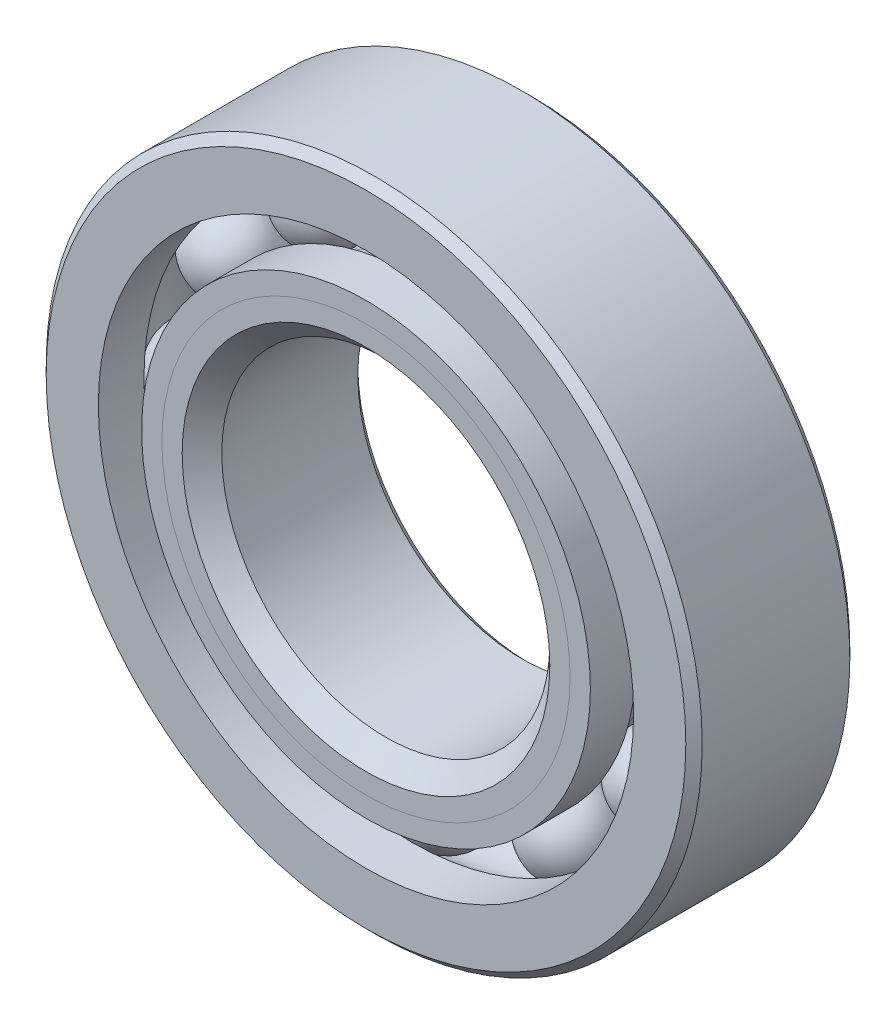
ISO-10303-21;
HEADER;
FILE_DESCRIPTION(('STEP AP214'),'2;1');
FILE_NAME('part.step','',(''),(''),'','','');
FILE_SCHEMA(('AUTOMOTIVE_DESIGN { 1 0 10303 214 1 1 1 1 }'));
ENDSEC;
DATA;
#1=APPLICATION_CONTEXT('core data for automotive mechanical design processes');
#2=APPLICATION_PROTOCOL_DEFINITION('international standard','automotive_design',2000,#1);
#3=PRODUCT_CONTEXT('',#1,'mechanical');
#4=PRODUCT('Part','Part','',(#3));
#5=PRODUCT_RELATED_PRODUCT_CATEGORY('part','',(#4));
#6=PRODUCT_DEFINITION_FORMATION('','',#4);
#7=PRODUCT_DEFINITION_CONTEXT('part definition',#1,'design');
#8=PRODUCT_DEFINITION('design','',#6,#7);
#9=PRODUCT_DEFINITION_SHAPE('','',#8);
#10=(LENGTH_UNIT() NAMED_UNIT(*) SI_UNIT(.MILLI.,.METRE.));
#11=(NAMED_UNIT(*) PLANE_ANGLE_UNIT() SI_UNIT($,.RADIAN.));
#12=(NAMED_UNIT(*) SI_UNIT($,.STERADIAN.) SOLID_ANGLE_UNIT());
#13=UNCERTAINTY_MEASURE_WITH_UNIT(LENGTH_MEASURE(1.E-05),#10,'distance_accuracy_value','');
#14=(GEOMETRIC_REPRESENTATION_CONTEXT(3) GLOBAL_UNCERTAINTY_ASSIGNED_CONTEXT((#13)) GLOBAL_UNIT_ASSIGNED_CONTEXT((#10,
#11,#12)) REPRESENTATION_CONTEXT('',''));
#15=CARTESIAN_POINT('',(0.,0.,0.));
#16=DIRECTION('',(0.,0.,1.));
#17=DIRECTION('',(1.,0.,0.));
#18=AXIS2_PLACEMENT_3D('',#15,#16,#17);
#19=CARTESIAN_POINT('',(-2.38124999999995,4.12444598552342,0.));
#20=DIRECTION('',(0.,0.,1.));
#21=DIRECTION('',(-0.499999999999989,0.866025403784445,0.));
#22=AXIS2_PLACEMENT_3D('',#19,#20,#21);
#23=SPHERICAL_SURFACE('',#22,0.820428356767388);
#24=CARTESIAN_POINT('',(-2.38124999999995,4.12444598552342,0.820428356767388));
#25=VERTEX_POINT('',#24);
#26=VERTEX_LOOP('',#25);
#27=FACE_BOUND('',#26,.T.);
#28=ADVANCED_FACE('F46',(#27),#23,.T.);
#29=CLOSED_SHELL('',(#28));
#30=MANIFOLD_SOLID_BREP('B2',#29);
#31=CARTESIAN_POINT('',(-4.12444598552336,2.38125000000005,0.));
#32=DIRECTION('',(0.,0.,1.));
#33=DIRECTION('',(-0.866025403784433,0.50000000000001,0.));
#34=AXIS2_PLACEMENT_3D('',#31,#32,#33);
#35=SPHERICAL_SURFACE('',#34,0.820428356767388);
#36=CARTESIAN_POINT('',(-4.12444598552336,2.38125000000005,0.820428356767388));
#37=VERTEX_POINT('',#36);
#38=VERTEX_LOOP('',#37);
#39=FACE_BOUND('',#38,.T.);
#40=ADVANCED_FACE('F85',(#39),#35,.T.);
#41=CLOSED_SHELL('',(#40));
#42=MANIFOLD_SOLID_BREP('B6',#41);
#43=CARTESIAN_POINT('',(-4.7625,0.,0.));
#44=DIRECTION('',(0.,0.,1.));
#45=DIRECTION('',(-1.,0.,0.));
#46=AXIS2_PLACEMENT_3D('',#43,#44,#45);
#47=SPHERICAL_SURFACE('',#46,0.820428356767388);
#48=CARTESIAN_POINT('',(-4.7625,0.,0.820428356767388));
#49=VERTEX_POINT('',#48);
#50=VERTEX_LOOP('',#49);
#51=FACE_BOUND('',#50,.T.);
#52=ADVANCED_FACE('F124',(#51),#47,.T.);
#53=CLOSED_SHELL('',(#52));
#54=MANIFOLD_SOLID_BREP('B42',#53);
#55=CARTESIAN_POINT('',(-4.12444598552341,-2.38124999999996,0.));
#56=DIRECTION('',(0.,0.,1.));
#57=DIRECTION('',(-0.866025403784443,-0.499999999999992,0.));
#58=AXIS2_PLACEMENT_3D('',#55,#56,#57);
#59=SPHERICAL_SURFACE('',#58,0.820428356767388);
#60=CARTESIAN_POINT('',(-4.12444598552341,-2.38124999999996,0.820428356767388));
#61=VERTEX_POINT('',#60);
#62=VERTEX_LOOP('',#61);
#63=FACE_BOUND('',#62,.T.);
#64=ADVANCED_FACE('F163',(#63),#59,.T.);
#65=CLOSED_SHELL('',(#64));
#66=MANIFOLD_SOLID_BREP('B81',#65);
#67=CARTESIAN_POINT('',(-2.38125000000003,-4.12444598552337,0.));
#68=DIRECTION('',(0.,0.,1.));
#69=DIRECTION('',(-0.500000000000007,-0.866025403784435,0.));
#70=AXIS2_PLACEMENT_3D('',#67,#68,#69);
#71=SPHERICAL_SURFACE('',#70,0.820428356767388);
#72=CARTESIAN_POINT('',(-2.38125000000003,-4.12444598552337,0.820428356767388));
#73=VERTEX_POINT('',#72);
#74=VERTEX_LOOP('',#73);
#75=FACE_BOUND('',#74,.T.);
#76=ADVANCED_FACE('F202',(#75),#71,.T.);
#77=CLOSED_SHELL('',(#76));
#78=MANIFOLD_SOLID_BREP('B120',#77);
#79=CARTESIAN_POINT('',(0.,-4.7625,0.));
#80=DIRECTION('',(0.,0.,1.));
#81=DIRECTION('',(0.,-1.,0.));
#82=AXIS2_PLACEMENT_3D('',#79,#80,#81);
#83=SPHERICAL_SURFACE('',#82,0.820428356767388);
#84=CARTESIAN_POINT('',(0.,-4.7625,0.820428356767388));
#85=VERTEX_POINT('',#84);
#86=VERTEX_LOOP('',#85);
#87=FACE_BOUND('',#86,.T.);
#88=ADVANCED_FACE('F241',(#87),#83,.T.);
#89=CLOSED_SHELL('',(#88));
#90=MANIFOLD_SOLID_BREP('B159',#89);
#91=CARTESIAN_POINT('',(2.38124999999998,-4.1244459855234,0.));
#92=DIRECTION('',(0.,0.,1.));
#93=DIRECTION('',(0.499999999999995,-0.866025403784442,0.));
#94=AXIS2_PLACEMENT_3D('',#91,#92,#93);
#95=SPHERICAL_SURFACE('',#94,0.820428356767388);
#96=CARTESIAN_POINT('',(2.38124999999998,-4.1244459855234,0.820428356767388));
#97=VERTEX_POINT('',#96);
#98=VERTEX_LOOP('',#97);
#99=FACE_BOUND('',#98,.T.);
#100=ADVANCED_FACE('F280',(#99),#95,.T.);
#101=CLOSED_SHELL('',(#100));
#102=MANIFOLD_SOLID_BREP('B198',#101);
#103=CARTESIAN_POINT('',(4.12444598552338,-2.38125000000002,0.));
#104=DIRECTION('',(0.,0.,1.));
#105=DIRECTION('',(0.866025403784436,-0.500000000000004,0.));
#106=AXIS2_PLACEMENT_3D('',#103,#104,#105);
#107=SPHERICAL_SURFACE('',#106,0.820428356767388);
#108=CARTESIAN_POINT('',(4.12444598552338,-2.38125000000002,0.820428356767388));
#109=VERTEX_POINT('',#108);
#110=VERTEX_LOOP('',#109);
#111=FACE_BOUND('',#110,.T.);
#112=ADVANCED_FACE('F319',(#111),#107,.T.);
#113=CLOSED_SHELL('',(#112));
#114=MANIFOLD_SOLID_BREP('B237',#113);
#115=CARTESIAN_POINT('',(4.7625,0.,0.));
#116=DIRECTION('',(0.,0.,1.));
#117=DIRECTION('',(1.,0.,0.));
#118=AXIS2_PLACEMENT_3D('',#115,#116,#117);
#119=SPHERICAL_SURFACE('',#118,0.820428356767388);
#120=CARTESIAN_POINT('',(4.7625,0.,0.820428356767388));
#121=VERTEX_POINT('',#120);
#122=VERTEX_LOOP('',#121);
#123=FACE_BOUND('',#122,.T.);
#124=ADVANCED_FACE('F358',(#123),#119,.T.);
#125=CLOSED_SHELL('',(#124));
#126=MANIFOLD_SOLID_BREP('B276',#125);
#127=CARTESIAN_POINT('',(4.12444598552339,2.38124999999999,0.));
#128=DIRECTION('',(0.,0.,1.));
#129=DIRECTION('',(0.86602540378444,0.499999999999998,0.));
#130=AXIS2_PLACEMENT_3D('',#127,#128,#129);
#131=SPHERICAL_SURFACE('',#130,0.820428356767388);
#132=CARTESIAN_POINT('',(4.12444598552339,2.38124999999999,0.820428356767388));
#133=VERTEX_POINT('',#132);
#134=VERTEX_LOOP('',#133);
#135=FACE_BOUND('',#134,.T.);
#136=ADVANCED_FACE('F397',(#135),#131,.T.);
#137=CLOSED_SHELL('',(#136));
#138=MANIFOLD_SOLID_BREP('B315',#137);
#139=CARTESIAN_POINT('',(2.38125,4.12444598552339,0.));
#140=DIRECTION('',(0.,0.,1.));
#141=DIRECTION('',(0.500000000000001,0.866025403784438,0.));
#142=AXIS2_PLACEMENT_3D('',#139,#140,#141);
#143=SPHERICAL_SURFACE('',#142,0.820428356767388);
#144=CARTESIAN_POINT('',(2.38125,4.12444598552339,0.820428356767388));
#145=VERTEX_POINT('',#144);
#146=VERTEX_LOOP('',#145);
#147=FACE_BOUND('',#146,.T.);
#148=ADVANCED_FACE('F436',(#147),#143,.T.);
#149=CLOSED_SHELL('',(#148));
#150=MANIFOLD_SOLID_BREP('B354',#149);
#151=CARTESIAN_POINT('',(0.,4.7625,0.));
#152=DIRECTION('',(0.,0.,1.));
#153=DIRECTION('',(0.,1.,0.));
#154=AXIS2_PLACEMENT_3D('',#151,#152,#153);
#155=SPHERICAL_SURFACE('',#154,0.820428356767388);
#156=CARTESIAN_POINT('',(0.,4.7625,0.820428356767388));
#157=VERTEX_POINT('',#156);
#158=VERTEX_LOOP('',#157);
#159=FACE_BOUND('',#158,.T.);
#160=ADVANCED_FACE('F477',(#159),#155,.T.);
#161=CLOSED_SHELL('',(#160));
#162=MANIFOLD_SOLID_BREP('B393',#161);
#163=CARTESIAN_POINT('',(0.,3.95117725146749,1.5875));
#164=DIRECTION('',(0.,0.,-1.));
#165=DIRECTION('',(-1.,0.,0.));
#166=AXIS2_PLACEMENT_3D('',#163,#164,#165);
#167=PLANE('',#166);
#168=CARTESIAN_POINT('',(0.,0.,1.5875));
#169=DIRECTION('',(0.,0.,1.));
#170=DIRECTION('',(1.,0.,0.));
#171=AXIS2_PLACEMENT_3D('',#168,#169,#170);
#172=CIRCLE('',#171,3.55853582161631);
#173=CARTESIAN_POINT('',(3.55853582161631,0.,1.5875));
#174=VERTEX_POINT('',#173);
#175=EDGE_CURVE('E530',#174,#174,#172,.T.);
#176=ORIENTED_EDGE('',*,*,#175,.F.);
#177=EDGE_LOOP('',(#176));
#178=FACE_BOUND('',#177,.T.);
#179=CARTESIAN_POINT('',(0.,0.,1.5875));
#180=DIRECTION('',(0.,0.,1.));
#181=DIRECTION('',(1.,0.,0.));
#182=AXIS2_PLACEMENT_3D('',#179,#180,#181);
#183=CIRCLE('',#182,3.95117725146749);
#184=CARTESIAN_POINT('',(3.95117725146749,0.,1.5875));
#185=VERTEX_POINT('',#184);
#186=EDGE_CURVE('E476',#185,#185,#183,.T.);
#187=ORIENTED_EDGE('',*,*,#186,.T.);
#188=EDGE_LOOP('',(#187));
#189=FACE_BOUND('',#188,.T.);
#190=ADVANCED_FACE('F496',(#178,#189),#167,.F.);
#191=CARTESIAN_POINT('',(0.,0.,1.19485857014881));
#192=DIRECTION('',(0.,0.,1.));
#193=DIRECTION('',(1.,0.,0.));
#194=AXIS2_PLACEMENT_3D('',#191,#192,#193);
#195=CONICAL_SURFACE('',#194,3.55853582161631,0.785398163397449);
#196=ORIENTED_EDGE('',*,*,#186,.F.);
#197=EDGE_LOOP('',(#196));
#198=FACE_BOUND('',#197,.T.);
#199=CARTESIAN_POINT('',(0.,0.,1.19485857014881));
#200=DIRECTION('',(0.,0.,1.));
#201=DIRECTION('',(1.,0.,0.));
#202=AXIS2_PLACEMENT_3D('',#199,#200,#201);
#203=CIRCLE('',#202,3.55853582161631);
#204=CARTESIAN_POINT('',(3.55853582161631,0.,1.19485857014881));
#205=VERTEX_POINT('',#204);
#206=EDGE_CURVE('E502',#205,#205,#203,.T.);
#207=ORIENTED_EDGE('',*,*,#206,.T.);
#208=EDGE_LOOP('',(#207));
#209=FACE_BOUND('',#208,.T.);
#210=ADVANCED_FACE('F537',(#198,#209),#195,.T.);
#211=CARTESIAN_POINT('',(0.,0.,1.5875));
#212=DIRECTION('',(0.,0.,1.));
#213=DIRECTION('',(1.,0.,0.));
#214=AXIS2_PLACEMENT_3D('',#211,#212,#213);
#215=CYLINDRICAL_SURFACE('',#214,3.55853582161631);
#216=ORIENTED_EDGE('',*,*,#206,.F.);
#217=EDGE_LOOP('',(#216));
#218=FACE_BOUND('',#217,.T.);
#219=CARTESIAN_POINT('',(0.,0.,0.));
#220=DIRECTION('',(0.,0.,1.));
#221=DIRECTION('',(1.,0.,0.));
#222=AXIS2_PLACEMENT_3D('',#219,#220,#221);
#223=CIRCLE('',#222,3.55853582161631);
#224=CARTESIAN_POINT('',(3.55853582161631,0.,0.));
#225=VERTEX_POINT('',#224);
#226=EDGE_CURVE('E506',#225,#225,#223,.T.);
#227=ORIENTED_EDGE('',*,*,#226,.T.);
#228=EDGE_LOOP('',(#227));
#229=FACE_BOUND('',#228,.T.);
#230=ADVANCED_FACE('F541',(#218,#229),#215,.T.);
#231=CARTESIAN_POINT('',(0.,3.55853582161631,0.));
#232=DIRECTION('',(0.,0.,-1.));
#233=DIRECTION('',(-1.,0.,0.));
#234=AXIS2_PLACEMENT_3D('',#231,#232,#233);
#235=PLANE('',#234);
#236=ORIENTED_EDGE('',*,*,#226,.F.);
#237=EDGE_LOOP('',(#236));
#238=FACE_BOUND('',#237,.T.);
#239=CARTESIAN_POINT('',(0.,0.,0.));
#240=DIRECTION('',(0.,0.,1.));
#241=DIRECTION('',(1.,0.,0.));
#242=AXIS2_PLACEMENT_3D('',#239,#240,#241);
#243=CIRCLE('',#242,3.94207164323261);
#244=CARTESIAN_POINT('',(3.94207164323261,0.,0.));
#245=VERTEX_POINT('',#244);
#246=EDGE_CURVE('E510',#245,#245,#243,.T.);
#247=ORIENTED_EDGE('',*,*,#246,.T.);
#248=EDGE_LOOP('',(#247));
#249=FACE_BOUND('',#248,.T.);
#250=ADVANCED_FACE('F546',(#238,#249),#235,.F.);
#251=CARTESIAN_POINT('',(0.,0.,0.));
#252=DIRECTION('',(0.,0.,1.));
#253=DIRECTION('',(1.,0.,0.));
#254=AXIS2_PLACEMENT_3D('',#251,#252,#253);
#255=TOROIDAL_SURFACE('',#254,4.7625,0.820428356767388);
#256=ORIENTED_EDGE('',*,*,#246,.F.);
#257=EDGE_LOOP('',(#256));
#258=FACE_BOUND('',#257,.T.);
#259=CARTESIAN_POINT('',(0.,0.,-0.705555555555556));
#260=DIRECTION('',(0.,0.,1.));
#261=DIRECTION('',(1.,0.,0.));
#262=AXIS2_PLACEMENT_3D('',#259,#260,#261);
#263=CIRCLE('',#262,4.34381868131868);
#264=CARTESIAN_POINT('',(4.34381868131868,0.,-0.705555555555556));
#265=VERTEX_POINT('',#264);
#266=EDGE_CURVE('E515',#265,#265,#263,.T.);
#267=ORIENTED_EDGE('',*,*,#266,.T.);
#268=EDGE_LOOP('',(#267));
#269=FACE_BOUND('',#268,.T.);
#270=ADVANCED_FACE('F552',(#258,#269),#255,.F.);
#271=CARTESIAN_POINT('',(0.,0.,1.5875));
#272=DIRECTION('',(0.,0.,1.));
#273=DIRECTION('',(1.,0.,0.));
#274=AXIS2_PLACEMENT_3D('',#271,#272,#273);
#275=CYLINDRICAL_SURFACE('',#274,4.34381868131868);
#276=ORIENTED_EDGE('',*,*,#266,.F.);
#277=EDGE_LOOP('',(#276));
#278=FACE_BOUND('',#277,.T.);
#279=CARTESIAN_POINT('',(0.,0.,-1.5875));
#280=DIRECTION('',(0.,0.,1.));
#281=DIRECTION('',(1.,0.,0.));
#282=AXIS2_PLACEMENT_3D('',#279,#280,#281);
#283=CIRCLE('',#282,4.34381868131868);
#284=CARTESIAN_POINT('',(4.34381868131868,0.,-1.5875));
#285=VERTEX_POINT('',#284);
#286=EDGE_CURVE('E518',#285,#285,#283,.T.);
#287=ORIENTED_EDGE('',*,*,#286,.T.);
#288=EDGE_LOOP('',(#287));
#289=FACE_BOUND('',#288,.T.);
#290=ADVANCED_FACE('F556',(#278,#289),#275,.T.);
#291=CARTESIAN_POINT('',(0.,3.33375,-1.5875));
#292=DIRECTION('',(0.,0.,1.));
#293=DIRECTION('',(1.,0.,0.));
#294=AXIS2_PLACEMENT_3D('',#291,#292,#293);
#295=PLANE('',#294);
#296=ORIENTED_EDGE('',*,*,#286,.F.);
#297=EDGE_LOOP('',(#296));
#298=FACE_BOUND('',#297,.T.);
#299=CARTESIAN_POINT('',(0.,0.,-1.5875));
#300=DIRECTION('',(0.,0.,1.));
#301=DIRECTION('',(1.,0.,0.));
#302=AXIS2_PLACEMENT_3D('',#299,#300,#301);
#303=CIRCLE('',#302,3.33375);
#304=CARTESIAN_POINT('',(3.33375,0.,-1.5875));
#305=VERTEX_POINT('',#304);
#306=EDGE_CURVE('E521',#305,#305,#303,.T.);
#307=ORIENTED_EDGE('',*,*,#306,.T.);
#308=EDGE_LOOP('',(#307));
#309=FACE_BOUND('',#308,.T.);
#310=ADVANCED_FACE('F560',(#298,#309),#295,.F.);
#311=CARTESIAN_POINT('',(0.,0.,-1.42875));
#312=DIRECTION('',(0.,0.,-1.));
#313=DIRECTION('',(-1.,0.,0.));
#314=AXIS2_PLACEMENT_3D('',#311,#312,#313);
#315=CONICAL_SURFACE('',#314,3.175,0.785398163397448);
#316=ORIENTED_EDGE('',*,*,#306,.F.);
#317=EDGE_LOOP('',(#316));
#318=FACE_BOUND('',#317,.T.);
#319=CARTESIAN_POINT('',(0.,0.,-1.42875));
#320=DIRECTION('',(0.,0.,1.));
#321=DIRECTION('',(1.,0.,0.));
#322=AXIS2_PLACEMENT_3D('',#319,#320,#321);
#323=CIRCLE('',#322,3.175);
#324=CARTESIAN_POINT('',(3.175,0.,-1.42875));
#325=VERTEX_POINT('',#324);
#326=EDGE_CURVE('E524',#325,#325,#323,.T.);
#327=ORIENTED_EDGE('',*,*,#326,.T.);
#328=EDGE_LOOP('',(#327));
#329=FACE_BOUND('',#328,.T.);
#330=ADVANCED_FACE('F564',(#318,#329),#315,.F.);
#331=CARTESIAN_POINT('',(0.,0.,1.5875));
#332=DIRECTION('',(0.,0.,1.));
#333=DIRECTION('',(1.,0.,0.));
#334=AXIS2_PLACEMENT_3D('',#331,#332,#333);
#335=CYLINDRICAL_SURFACE('',#334,3.175);
#336=ORIENTED_EDGE('',*,*,#326,.F.);
#337=EDGE_LOOP('',(#336));
#338=FACE_BOUND('',#337,.T.);
#339=CARTESIAN_POINT('',(0.,0.,1.20396417838369));
#340=DIRECTION('',(0.,0.,1.));
#341=DIRECTION('',(1.,0.,0.));
#342=AXIS2_PLACEMENT_3D('',#339,#340,#341);
#343=CIRCLE('',#342,3.175);
#344=CARTESIAN_POINT('',(3.175,0.,1.20396417838369));
#345=VERTEX_POINT('',#344);
#346=EDGE_CURVE('E527',#345,#345,#343,.T.);
#347=ORIENTED_EDGE('',*,*,#346,.T.);
#348=EDGE_LOOP('',(#347));
#349=FACE_BOUND('',#348,.T.);
#350=ADVANCED_FACE('F568',(#338,#349),#335,.F.);
#351=CARTESIAN_POINT('',(0.,0.,1.5875));
#352=DIRECTION('',(0.,0.,1.));
#353=DIRECTION('',(1.,0.,0.));
#354=AXIS2_PLACEMENT_3D('',#351,#352,#353);
#355=CONICAL_SURFACE('',#354,3.55853582161631,0.785398163397449);
#356=ORIENTED_EDGE('',*,*,#346,.F.);
#357=EDGE_LOOP('',(#356));
#358=FACE_BOUND('',#357,.T.);
#359=ORIENTED_EDGE('',*,*,#175,.T.);
#360=EDGE_LOOP('',(#359));
#361=FACE_BOUND('',#360,.T.);
#362=ADVANCED_FACE('F534',(#358,#361),#355,.F.);
#363=CLOSED_SHELL('',(#190,#210,#230,#250,#270,#290,#310,#330,#350,#362));
#364=MANIFOLD_SOLID_BREP('B432',#363);
#365=CARTESIAN_POINT('',(0.,4.34381868131868,1.5875));
#366=DIRECTION('',(0.,0.,-1.));
#367=DIRECTION('',(-1.,0.,0.));
#368=AXIS2_PLACEMENT_3D('',#365,#366,#367);
#369=PLANE('',#368);
#370=CARTESIAN_POINT('',(0.,0.,1.5875));
#371=DIRECTION('',(0.,0.,1.));
#372=DIRECTION('',(1.,0.,0.));
#373=AXIS2_PLACEMENT_3D('',#370,#371,#372);
#374=CIRCLE('',#373,3.95117725146749);
#375=CARTESIAN_POINT('',(3.95117725146749,0.,1.5875));
#376=VERTEX_POINT('',#375);
#377=EDGE_CURVE('E495',#376,#376,#374,.T.);
#378=ORIENTED_EDGE('',*,*,#377,.F.);
#379=EDGE_LOOP('',(#378));
#380=FACE_BOUND('',#379,.T.);
#381=CARTESIAN_POINT('',(0.,0.,1.5875));
#382=DIRECTION('',(0.,0.,1.));
#383=DIRECTION('',(1.,0.,0.));
#384=AXIS2_PLACEMENT_3D('',#381,#382,#383);
#385=CIRCLE('',#384,4.34381868131868);
#386=CARTESIAN_POINT('',(4.34381868131868,0.,1.5875));
#387=VERTEX_POINT('',#386);
#388=EDGE_CURVE('E657',#387,#387,#385,.T.);
#389=ORIENTED_EDGE('',*,*,#388,.T.);
#390=EDGE_LOOP('',(#389));
#391=FACE_BOUND('',#390,.T.);
#392=ADVANCED_FACE('F635',(#380,#391),#369,.F.);
#393=CARTESIAN_POINT('',(0.,0.,1.5875));
#394=DIRECTION('',(0.,0.,1.));
#395=DIRECTION('',(1.,0.,0.));
#396=AXIS2_PLACEMENT_3D('',#393,#394,#395);
#397=CONICAL_SURFACE('',#396,3.95117725146749,0.785398163397449);
#398=CARTESIAN_POINT('',(0.,0.,1.19485857014881));
#399=DIRECTION('',(0.,0.,1.));
#400=DIRECTION('',(1.,0.,0.));
#401=AXIS2_PLACEMENT_3D('',#398,#399,#400);
#402=CIRCLE('',#401,3.55853582161631);
#403=CARTESIAN_POINT('',(3.55853582161631,0.,1.19485857014881));
#404=VERTEX_POINT('',#403);
#405=EDGE_CURVE('E641',#404,#404,#402,.T.);
#406=ORIENTED_EDGE('',*,*,#405,.F.);
#407=EDGE_LOOP('',(#406));
#408=FACE_BOUND('',#407,.T.);
#409=ORIENTED_EDGE('',*,*,#377,.T.);
#410=EDGE_LOOP('',(#409));
#411=FACE_BOUND('',#410,.T.);
#412=ADVANCED_FACE('F682',(#408,#411),#397,.F.);
#413=CARTESIAN_POINT('',(0.,0.,1.5875));
#414=DIRECTION('',(0.,0.,1.));
#415=DIRECTION('',(1.,0.,0.));
#416=AXIS2_PLACEMENT_3D('',#413,#414,#415);
#417=CYLINDRICAL_SURFACE('',#416,3.55853582161631);
#418=CARTESIAN_POINT('',(0.,0.,0.));
#419=DIRECTION('',(0.,0.,1.));
#420=DIRECTION('',(1.,0.,0.));
#421=AXIS2_PLACEMENT_3D('',#418,#419,#420);
#422=CIRCLE('',#421,3.55853582161631);
#423=CARTESIAN_POINT('',(3.55853582161631,0.,0.));
#424=VERTEX_POINT('',#423);
#425=EDGE_CURVE('E645',#424,#424,#422,.T.);
#426=ORIENTED_EDGE('',*,*,#425,.F.);
#427=EDGE_LOOP('',(#426));
#428=FACE_BOUND('',#427,.T.);
#429=ORIENTED_EDGE('',*,*,#405,.T.);
#430=EDGE_LOOP('',(#429));
#431=FACE_BOUND('',#430,.T.);
#432=ADVANCED_FACE('F677',(#428,#431),#417,.F.);
#433=CARTESIAN_POINT('',(0.,3.55853582161631,0.));
#434=DIRECTION('',(0.,0.,1.));
#435=DIRECTION('',(1.,0.,0.));
#436=AXIS2_PLACEMENT_3D('',#433,#434,#435);
#437=PLANE('',#436);
#438=CARTESIAN_POINT('',(0.,0.,0.));
#439=DIRECTION('',(0.,0.,1.));
#440=DIRECTION('',(1.,0.,0.));
#441=AXIS2_PLACEMENT_3D('',#438,#439,#440);
#442=CIRCLE('',#441,3.94207164323261);
#443=CARTESIAN_POINT('',(3.94207164323261,0.,0.));
#444=VERTEX_POINT('',#443);
#445=EDGE_CURVE('E649',#444,#444,#442,.T.);
#446=ORIENTED_EDGE('',*,*,#445,.F.);
#447=EDGE_LOOP('',(#446));
#448=FACE_BOUND('',#447,.T.);
#449=ORIENTED_EDGE('',*,*,#425,.T.);
#450=EDGE_LOOP('',(#449));
#451=FACE_BOUND('',#450,.T.);
#452=ADVANCED_FACE('F671',(#448,#451),#437,.F.);
#453=CARTESIAN_POINT('',(0.,0.,0.));
#454=DIRECTION('',(0.,0.,1.));
#455=DIRECTION('',(1.,0.,0.));
#456=AXIS2_PLACEMENT_3D('',#453,#454,#455);
#457=TOROIDAL_SURFACE('',#456,4.7625,0.820428356767388);
#458=CARTESIAN_POINT('',(0.,0.,0.705555555555555));
#459=DIRECTION('',(0.,0.,1.));
#460=DIRECTION('',(1.,0.,0.));
#461=AXIS2_PLACEMENT_3D('',#458,#459,#460);
#462=CIRCLE('',#461,4.34381868131868);
#463=CARTESIAN_POINT('',(4.34381868131868,0.,0.705555555555555));
#464=VERTEX_POINT('',#463);
#465=EDGE_CURVE('E654',#464,#464,#462,.T.);
#466=ORIENTED_EDGE('',*,*,#465,.F.);
#467=EDGE_LOOP('',(#466));
#468=FACE_BOUND('',#467,.T.);
#469=ORIENTED_EDGE('',*,*,#445,.T.);
#470=EDGE_LOOP('',(#469));
#471=FACE_BOUND('',#470,.T.);
#472=ADVANCED_FACE('F665',(#468,#471),#457,.F.);
#473=CARTESIAN_POINT('',(0.,0.,1.5875));
#474=DIRECTION('',(0.,0.,1.));
#475=DIRECTION('',(1.,0.,0.));
#476=AXIS2_PLACEMENT_3D('',#473,#474,#475);
#477=CYLINDRICAL_SURFACE('',#476,4.34381868131868);
#478=ORIENTED_EDGE('',*,*,#388,.F.);
#479=EDGE_LOOP('',(#478));
#480=FACE_BOUND('',#479,.T.);
#481=ORIENTED_EDGE('',*,*,#465,.T.);
#482=EDGE_LOOP('',(#481));
#483=FACE_BOUND('',#482,.T.);
#484=ADVANCED_FACE('F662',(#480,#483),#477,.T.);
#485=CLOSED_SHELL('',(#392,#412,#432,#452,#472,#484));
#486=MANIFOLD_SOLID_BREP('B471',#485);
#487=CARTESIAN_POINT('',(0.,0.,1.42875));
#488=DIRECTION('',(0.,0.,-1.));
#489=DIRECTION('',(-1.,0.,0.));
#490=AXIS2_PLACEMENT_3D('',#487,#488,#489);
#491=CONICAL_SURFACE('',#490,6.35,0.785398163397446);
#492=CARTESIAN_POINT('',(0.,0.,1.5875));
#493=DIRECTION('',(0.,0.,1.));
#494=DIRECTION('',(1.,0.,0.));
#495=AXIS2_PLACEMENT_3D('',#492,#493,#494);
#496=CIRCLE('',#495,6.19125);
#497=CARTESIAN_POINT('',(6.19125,0.,1.5875));
#498=VERTEX_POINT('',#497);
#499=EDGE_CURVE('E743',#498,#498,#496,.T.);
#500=ORIENTED_EDGE('',*,*,#499,.F.);
#501=EDGE_LOOP('',(#500));
#502=FACE_BOUND('',#501,.T.);
#503=CARTESIAN_POINT('',(0.,0.,1.42875));
#504=DIRECTION('',(0.,0.,1.));
#505=DIRECTION('',(1.,0.,0.));
#506=AXIS2_PLACEMENT_3D('',#503,#504,#505);
#507=CIRCLE('',#506,6.35);
#508=CARTESIAN_POINT('',(6.35,0.,1.42875));
#509=VERTEX_POINT('',#508);
#510=EDGE_CURVE('E634',#509,#509,#507,.T.);
#511=ORIENTED_EDGE('',*,*,#510,.T.);
#512=EDGE_LOOP('',(#511));
#513=FACE_BOUND('',#512,.T.);
#514=ADVANCED_FACE('F715',(#502,#513),#491,.T.);
#515=CARTESIAN_POINT('',(0.,0.,1.5875));
#516=DIRECTION('',(0.,0.,1.));
#517=DIRECTION('',(1.,0.,0.));
#518=AXIS2_PLACEMENT_3D('',#515,#516,#517);
#519=CYLINDRICAL_SURFACE('',#518,6.35);
#520=ORIENTED_EDGE('',*,*,#510,.F.);
#521=EDGE_LOOP('',(#520));
#522=FACE_BOUND('',#521,.T.);
#523=CARTESIAN_POINT('',(0.,0.,-1.42875));
#524=DIRECTION('',(0.,0.,1.));
#525=DIRECTION('',(1.,0.,0.));
#526=AXIS2_PLACEMENT_3D('',#523,#524,#525);
#527=CIRCLE('',#526,6.35);
#528=CARTESIAN_POINT('',(6.35,0.,-1.42875));
#529=VERTEX_POINT('',#528);
#530=EDGE_CURVE('E721',#529,#529,#527,.T.);
#531=ORIENTED_EDGE('',*,*,#530,.T.);
#532=EDGE_LOOP('',(#531));
#533=FACE_BOUND('',#532,.T.);
#534=ADVANCED_FACE('F750',(#522,#533),#519,.T.);
#535=CARTESIAN_POINT('',(0.,0.,-1.5875));
#536=DIRECTION('',(0.,0.,1.));
#537=DIRECTION('',(1.,0.,0.));
#538=AXIS2_PLACEMENT_3D('',#535,#536,#537);
#539=CONICAL_SURFACE('',#538,6.19125,0.785398163397446);
#540=ORIENTED_EDGE('',*,*,#530,.F.);
#541=EDGE_LOOP('',(#540));
#542=FACE_BOUND('',#541,.T.);
#543=CARTESIAN_POINT('',(0.,0.,-1.5875));
#544=DIRECTION('',(0.,0.,1.));
#545=DIRECTION('',(1.,0.,0.));
#546=AXIS2_PLACEMENT_3D('',#543,#544,#545);
#547=CIRCLE('',#546,6.19125);
#548=CARTESIAN_POINT('',(6.19125,0.,-1.5875));
#549=VERTEX_POINT('',#548);
#550=EDGE_CURVE('E725',#549,#549,#547,.T.);
#551=ORIENTED_EDGE('',*,*,#550,.T.);
#552=EDGE_LOOP('',(#551));
#553=FACE_BOUND('',#552,.T.);
#554=ADVANCED_FACE('F754',(#542,#553),#539,.T.);
#555=CARTESIAN_POINT('',(0.,6.19125,-1.5875));
#556=DIRECTION('',(0.,0.,1.));
#557=DIRECTION('',(1.,0.,0.));
#558=AXIS2_PLACEMENT_3D('',#555,#556,#557);
#559=PLANE('',#558);
#560=ORIENTED_EDGE('',*,*,#550,.F.);
#561=EDGE_LOOP('',(#560));
#562=FACE_BOUND('',#561,.T.);
#563=CARTESIAN_POINT('',(0.,0.,-1.5875));
#564=DIRECTION('',(0.,0.,1.));
#565=DIRECTION('',(1.,0.,0.));
#566=AXIS2_PLACEMENT_3D('',#563,#564,#565);
#567=CIRCLE('',#566,5.18118131868132);
#568=CARTESIAN_POINT('',(5.18118131868132,0.,-1.5875));
#569=VERTEX_POINT('',#568);
#570=EDGE_CURVE('E729',#569,#569,#567,.T.);
#571=ORIENTED_EDGE('',*,*,#570,.T.);
#572=EDGE_LOOP('',(#571));
#573=FACE_BOUND('',#572,.T.);
#574=ADVANCED_FACE('F759',(#562,#573),#559,.F.);
#575=CARTESIAN_POINT('',(0.,0.,1.5875));
#576=DIRECTION('',(0.,0.,1.));
#577=DIRECTION('',(1.,0.,0.));
#578=AXIS2_PLACEMENT_3D('',#575,#576,#577);
#579=CYLINDRICAL_SURFACE('',#578,5.18118131868132);
#580=ORIENTED_EDGE('',*,*,#570,.F.);
#581=EDGE_LOOP('',(#580));
#582=FACE_BOUND('',#581,.T.);
#583=CARTESIAN_POINT('',(0.,0.,-0.705555555555556));
#584=DIRECTION('',(0.,0.,1.));
#585=DIRECTION('',(1.,0.,0.));
#586=AXIS2_PLACEMENT_3D('',#583,#584,#585);
#587=CIRCLE('',#586,5.18118131868132);
#588=CARTESIAN_POINT('',(5.18118131868132,0.,-0.705555555555556));
#589=VERTEX_POINT('',#588);
#590=EDGE_CURVE('E734',#589,#589,#587,.T.);
#591=ORIENTED_EDGE('',*,*,#590,.T.);
#592=EDGE_LOOP('',(#591));
#593=FACE_BOUND('',#592,.T.);
#594=ADVANCED_FACE('F765',(#582,#593),#579,.F.);
#595=CARTESIAN_POINT('',(0.,0.,0.));
#596=DIRECTION('',(0.,0.,1.));
#597=DIRECTION('',(1.,0.,0.));
#598=AXIS2_PLACEMENT_3D('',#595,#596,#597);
#599=TOROIDAL_SURFACE('',#598,4.7625,0.820428356767388);
#600=ORIENTED_EDGE('',*,*,#590,.F.);
#601=EDGE_LOOP('',(#600));
#602=FACE_BOUND('',#601,.T.);
#603=CARTESIAN_POINT('',(0.,0.,0.705555555555555));
#604=DIRECTION('',(0.,0.,1.));
#605=DIRECTION('',(1.,0.,0.));
#606=AXIS2_PLACEMENT_3D('',#603,#604,#605);
#607=CIRCLE('',#606,5.18118131868132);
#608=CARTESIAN_POINT('',(5.18118131868132,0.,0.705555555555555));
#609=VERTEX_POINT('',#608);
#610=EDGE_CURVE('E737',#609,#609,#607,.T.);
#611=ORIENTED_EDGE('',*,*,#610,.T.);
#612=EDGE_LOOP('',(#611));
#613=FACE_BOUND('',#612,.T.);
#614=ADVANCED_FACE('F769',(#602,#613),#599,.F.);
#615=CARTESIAN_POINT('',(0.,0.,1.5875));
#616=DIRECTION('',(0.,0.,1.));
#617=DIRECTION('',(1.,0.,0.));
#618=AXIS2_PLACEMENT_3D('',#615,#616,#617);
#619=CYLINDRICAL_SURFACE('',#618,5.18118131868132);
#620=ORIENTED_EDGE('',*,*,#610,.F.);
#621=EDGE_LOOP('',(#620));
#622=FACE_BOUND('',#621,.T.);
#623=CARTESIAN_POINT('',(0.,0.,1.5875));
#624=DIRECTION('',(0.,0.,1.));
#625=DIRECTION('',(1.,0.,0.));
#626=AXIS2_PLACEMENT_3D('',#623,#624,#625);
#627=CIRCLE('',#626,5.18118131868132);
#628=CARTESIAN_POINT('',(5.18118131868132,0.,1.5875));
#629=VERTEX_POINT('',#628);
#630=EDGE_CURVE('E740',#629,#629,#627,.T.);
#631=ORIENTED_EDGE('',*,*,#630,.T.);
#632=EDGE_LOOP('',(#631));
#633=FACE_BOUND('',#632,.T.);
#634=ADVANCED_FACE('F773',(#622,#633),#619,.F.);
#635=CARTESIAN_POINT('',(0.,6.19125,1.5875));
#636=DIRECTION('',(0.,0.,-1.));
#637=DIRECTION('',(-1.,0.,0.));
#638=AXIS2_PLACEMENT_3D('',#635,#636,#637);
#639=PLANE('',#638);
#640=ORIENTED_EDGE('',*,*,#630,.F.);
#641=EDGE_LOOP('',(#640));
#642=FACE_BOUND('',#641,.T.);
#643=ORIENTED_EDGE('',*,*,#499,.T.);
#644=EDGE_LOOP('',(#643));
#645=FACE_BOUND('',#644,.T.);
#646=ADVANCED_FACE('F747',(#642,#645),#639,.F.);
#647=CLOSED_SHELL('',(#514,#534,#554,#574,#594,#614,#634,#646));
#648=MANIFOLD_SOLID_BREP('B490',#647);
#649=ADVANCED_BREP_SHAPE_REPRESENTATION('',(#18,#30,#42,#54,#66,#78,#90,#102,#114,#126,#138,
#150,#162,#364,#486,#648),#14);
#650=SHAPE_DEFINITION_REPRESENTATION(#9,#649);
ENDSEC;
END-ISO-10303-21;
